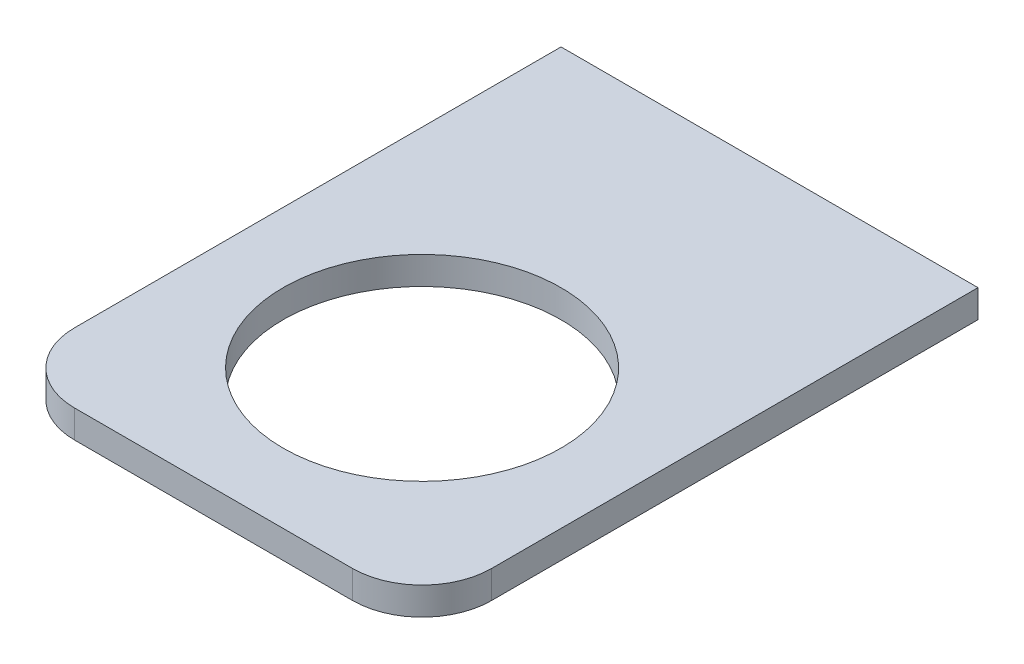
ISO-10303-21;
HEADER;
FILE_DESCRIPTION(('STEP AP214'),'2;1');
FILE_NAME('part.step','',(''),(''),'','','');
FILE_SCHEMA(('AUTOMOTIVE_DESIGN { 1 0 10303 214 1 1 1 1 }'));
ENDSEC;
DATA;
#1=APPLICATION_CONTEXT('core data for automotive mechanical design processes');
#2=APPLICATION_PROTOCOL_DEFINITION('international standard','automotive_design',2000,#1);
#3=PRODUCT_CONTEXT('',#1,'mechanical');
#4=PRODUCT('Part','Part','',(#3));
#5=PRODUCT_RELATED_PRODUCT_CATEGORY('part','',(#4));
#6=PRODUCT_DEFINITION_FORMATION('','',#4);
#7=PRODUCT_DEFINITION_CONTEXT('part definition',#1,'design');
#8=PRODUCT_DEFINITION('design','',#6,#7);
#9=PRODUCT_DEFINITION_SHAPE('','',#8);
#10=(LENGTH_UNIT() NAMED_UNIT(*) SI_UNIT(.MILLI.,.METRE.));
#11=(NAMED_UNIT(*) PLANE_ANGLE_UNIT() SI_UNIT($,.RADIAN.));
#12=(NAMED_UNIT(*) SI_UNIT($,.STERADIAN.) SOLID_ANGLE_UNIT());
#13=UNCERTAINTY_MEASURE_WITH_UNIT(LENGTH_MEASURE(1.E-05),#10,'distance_accuracy_value','');
#14=(GEOMETRIC_REPRESENTATION_CONTEXT(3) GLOBAL_UNCERTAINTY_ASSIGNED_CONTEXT((#13)) GLOBAL_UNIT_ASSIGNED_CONTEXT((#10,
#11,#12)) REPRESENTATION_CONTEXT('',''));
#15=CARTESIAN_POINT('',(0.,0.,0.));
#16=DIRECTION('',(0.,0.,1.));
#17=DIRECTION('',(1.,0.,0.));
#18=AXIS2_PLACEMENT_3D('',#15,#16,#17);
#19=CARTESIAN_POINT('',(-30.,176.,0.));
#20=DIRECTION('',(-1.,0.,0.));
#21=DIRECTION('',(0.,0.,1.));
#22=AXIS2_PLACEMENT_3D('',#19,#20,#21);
#23=PLANE('',#22);
#24=DIRECTION('',(0.,0.,1.));
#25=VECTOR('',#24,1.);
#26=CARTESIAN_POINT('',(-30.,176.,0.));
#27=LINE('',#26,#25);
#28=CARTESIAN_POINT('',(-30.,176.,0.));
#29=VERTEX_POINT('',#28);
#30=CARTESIAN_POINT('',(-30.,176.,70.));
#31=VERTEX_POINT('',#30);
#32=EDGE_CURVE('E114',#29,#31,#27,.T.);
#33=ORIENTED_EDGE('',*,*,#32,.T.);
#34=DIRECTION('',(0.,1.,0.));
#35=VECTOR('',#34,1.);
#36=CARTESIAN_POINT('',(-30.,176.,70.));
#37=LINE('',#36,#35);
#38=CARTESIAN_POINT('',(-30.,180.,70.));
#39=VERTEX_POINT('',#38);
#40=EDGE_CURVE('E135',#31,#39,#37,.T.);
#41=ORIENTED_EDGE('',*,*,#40,.T.);
#42=DIRECTION('',(0.,0.,1.));
#43=VECTOR('',#42,1.);
#44=CARTESIAN_POINT('',(-30.,180.,0.));
#45=LINE('',#44,#43);
#46=CARTESIAN_POINT('',(-30.,180.,0.));
#47=VERTEX_POINT('',#46);
#48=EDGE_CURVE('E121',#47,#39,#45,.T.);
#49=ORIENTED_EDGE('',*,*,#48,.F.);
#50=DIRECTION('',(0.,1.,0.));
#51=VECTOR('',#50,1.);
#52=CARTESIAN_POINT('',(-30.,176.,0.));
#53=LINE('',#52,#51);
#54=EDGE_CURVE('E109',#29,#47,#53,.T.);
#55=ORIENTED_EDGE('',*,*,#54,.F.);
#56=EDGE_LOOP('',(#33,#41,#49,#55));
#57=FACE_BOUND('',#56,.T.);
#58=ADVANCED_FACE('F41',(#57),#23,.T.);
#59=CARTESIAN_POINT('',(-30.,176.,0.));
#60=DIRECTION('',(0.,0.,-1.));
#61=DIRECTION('',(-1.,0.,0.));
#62=AXIS2_PLACEMENT_3D('',#59,#60,#61);
#63=PLANE('',#62);
#64=DIRECTION('',(-1.,0.,0.));
#65=VECTOR('',#64,1.);
#66=CARTESIAN_POINT('',(-30.,180.,0.));
#67=LINE('',#66,#65);
#68=CARTESIAN_POINT('',(30.,180.,0.));
#69=VERTEX_POINT('',#68);
#70=EDGE_CURVE('E107',#69,#47,#67,.T.);
#71=ORIENTED_EDGE('',*,*,#70,.F.);
#72=DIRECTION('',(0.,1.,0.));
#73=VECTOR('',#72,1.);
#74=CARTESIAN_POINT('',(30.,176.,0.));
#75=LINE('',#74,#73);
#76=CARTESIAN_POINT('',(30.,176.,0.));
#77=VERTEX_POINT('',#76);
#78=EDGE_CURVE('E96',#77,#69,#75,.T.);
#79=ORIENTED_EDGE('',*,*,#78,.F.);
#80=DIRECTION('',(-1.,0.,0.));
#81=VECTOR('',#80,1.);
#82=CARTESIAN_POINT('',(-30.,176.,0.));
#83=LINE('',#82,#81);
#84=EDGE_CURVE('E100',#77,#29,#83,.T.);
#85=ORIENTED_EDGE('',*,*,#84,.T.);
#86=ORIENTED_EDGE('',*,*,#54,.T.);
#87=EDGE_LOOP('',(#71,#79,#85,#86));
#88=FACE_BOUND('',#87,.T.);
#89=ADVANCED_FACE('F105',(#88),#63,.T.);
#90=CARTESIAN_POINT('',(30.,176.,0.));
#91=DIRECTION('',(1.,0.,0.));
#92=DIRECTION('',(0.,0.,-1.));
#93=AXIS2_PLACEMENT_3D('',#90,#91,#92);
#94=PLANE('',#93);
#95=DIRECTION('',(0.,0.,-1.));
#96=VECTOR('',#95,1.);
#97=CARTESIAN_POINT('',(30.,180.,0.));
#98=LINE('',#97,#96);
#99=CARTESIAN_POINT('',(30.,180.,70.));
#100=VERTEX_POINT('',#99);
#101=EDGE_CURVE('E129',#100,#69,#98,.T.);
#102=ORIENTED_EDGE('',*,*,#101,.F.);
#103=DIRECTION('',(0.,1.,0.));
#104=VECTOR('',#103,1.);
#105=CARTESIAN_POINT('',(30.,176.,70.));
#106=LINE('',#105,#104);
#107=CARTESIAN_POINT('',(30.,176.,70.));
#108=VERTEX_POINT('',#107);
#109=EDGE_CURVE('E11',#100,#108,#106,.F.);
#110=ORIENTED_EDGE('',*,*,#109,.T.);
#111=DIRECTION('',(0.,0.,-1.));
#112=VECTOR('',#111,1.);
#113=CARTESIAN_POINT('',(30.,176.,0.));
#114=LINE('',#113,#112);
#115=EDGE_CURVE('E93',#108,#77,#114,.T.);
#116=ORIENTED_EDGE('',*,*,#115,.T.);
#117=ORIENTED_EDGE('',*,*,#78,.T.);
#118=EDGE_LOOP('',(#102,#110,#116,#117));
#119=FACE_BOUND('',#118,.T.);
#120=ADVANCED_FACE('F95',(#119),#94,.T.);
#121=CARTESIAN_POINT('',(-30.,176.,80.));
#122=DIRECTION('',(0.,0.,1.));
#123=DIRECTION('',(1.,0.,0.));
#124=AXIS2_PLACEMENT_3D('',#121,#122,#123);
#125=PLANE('',#124);
#126=DIRECTION('',(1.,0.,0.));
#127=VECTOR('',#126,1.);
#128=CARTESIAN_POINT('',(-30.,180.,80.));
#129=LINE('',#128,#127);
#130=CARTESIAN_POINT('',(-20.,180.,80.));
#131=VERTEX_POINT('',#130);
#132=CARTESIAN_POINT('',(20.,180.,80.));
#133=VERTEX_POINT('',#132);
#134=EDGE_CURVE('E124',#131,#133,#129,.T.);
#135=ORIENTED_EDGE('',*,*,#134,.F.);
#136=DIRECTION('',(0.,1.,0.));
#137=VECTOR('',#136,1.);
#138=CARTESIAN_POINT('',(-20.,176.,80.));
#139=LINE('',#138,#137);
#140=CARTESIAN_POINT('',(-20.,176.,80.));
#141=VERTEX_POINT('',#140);
#142=EDGE_CURVE('E150',#131,#141,#139,.F.);
#143=ORIENTED_EDGE('',*,*,#142,.T.);
#144=DIRECTION('',(1.,0.,0.));
#145=VECTOR('',#144,1.);
#146=CARTESIAN_POINT('',(-30.,176.,80.));
#147=LINE('',#146,#145);
#148=CARTESIAN_POINT('',(20.,176.,80.));
#149=VERTEX_POINT('',#148);
#150=EDGE_CURVE('E101',#141,#149,#147,.T.);
#151=ORIENTED_EDGE('',*,*,#150,.T.);
#152=DIRECTION('',(0.,1.,0.));
#153=VECTOR('',#152,1.);
#154=CARTESIAN_POINT('',(20.,176.,80.));
#155=LINE('',#154,#153);
#156=EDGE_CURVE('E146',#149,#133,#155,.T.);
#157=ORIENTED_EDGE('',*,*,#156,.T.);
#158=EDGE_LOOP('',(#135,#143,#151,#157));
#159=FACE_BOUND('',#158,.T.);
#160=ADVANCED_FACE('F169',(#159),#125,.T.);
#161=CARTESIAN_POINT('',(0.,176.,0.));
#162=DIRECTION('',(0.,1.,0.));
#163=DIRECTION('',(0.,0.,1.));
#164=AXIS2_PLACEMENT_3D('',#161,#162,#163);
#165=PLANE('',#164);
#166=CARTESIAN_POINT('',(0.,176.,50.));
#167=DIRECTION('',(0.,1.,0.));
#168=DIRECTION('',(0.,0.,1.));
#169=AXIS2_PLACEMENT_3D('',#166,#167,#168);
#170=CIRCLE('',#169,20.);
#171=CARTESIAN_POINT('',(0.,176.,70.));
#172=VERTEX_POINT('',#171);
#173=EDGE_CURVE('E125',#172,#172,#170,.T.);
#174=ORIENTED_EDGE('',*,*,#173,.T.);
#175=EDGE_LOOP('',(#174));
#176=FACE_BOUND('',#175,.T.);
#177=ORIENTED_EDGE('',*,*,#150,.F.);
#178=CARTESIAN_POINT('',(-20.,176.,70.));
#179=DIRECTION('',(0.,1.,0.));
#180=DIRECTION('',(0.,0.,1.));
#181=AXIS2_PLACEMENT_3D('',#178,#179,#180);
#182=CIRCLE('',#181,10.);
#183=EDGE_CURVE('E50',#141,#31,#182,.F.);
#184=ORIENTED_EDGE('',*,*,#183,.T.);
#185=ORIENTED_EDGE('',*,*,#32,.F.);
#186=ORIENTED_EDGE('',*,*,#84,.F.);
#187=ORIENTED_EDGE('',*,*,#115,.F.);
#188=CARTESIAN_POINT('',(20.,176.,70.));
#189=DIRECTION('',(0.,1.,0.));
#190=DIRECTION('',(0.,0.,1.));
#191=AXIS2_PLACEMENT_3D('',#188,#189,#190);
#192=CIRCLE('',#191,10.);
#193=EDGE_CURVE('E62',#108,#149,#192,.F.);
#194=ORIENTED_EDGE('',*,*,#193,.T.);
#195=EDGE_LOOP('',(#177,#184,#185,#186,#187,#194));
#196=FACE_BOUND('',#195,.T.);
#197=ADVANCED_FACE('F112',(#176,#196),#165,.F.);
#198=CARTESIAN_POINT('',(0.,180.,0.));
#199=DIRECTION('',(0.,1.,0.));
#200=DIRECTION('',(0.,0.,1.));
#201=AXIS2_PLACEMENT_3D('',#198,#199,#200);
#202=PLANE('',#201);
#203=CARTESIAN_POINT('',(0.,180.,50.));
#204=DIRECTION('',(0.,1.,0.));
#205=DIRECTION('',(0.,0.,1.));
#206=AXIS2_PLACEMENT_3D('',#203,#204,#205);
#207=CIRCLE('',#206,20.);
#208=CARTESIAN_POINT('',(0.,180.,70.));
#209=VERTEX_POINT('',#208);
#210=EDGE_CURVE('E203',#209,#209,#207,.T.);
#211=ORIENTED_EDGE('',*,*,#210,.F.);
#212=EDGE_LOOP('',(#211));
#213=FACE_BOUND('',#212,.T.);
#214=ORIENTED_EDGE('',*,*,#48,.T.);
#215=CARTESIAN_POINT('',(-20.,180.,70.));
#216=DIRECTION('',(0.,1.,0.));
#217=DIRECTION('',(0.,0.,1.));
#218=AXIS2_PLACEMENT_3D('',#215,#216,#217);
#219=CIRCLE('',#218,10.);
#220=EDGE_CURVE('E143',#39,#131,#219,.T.);
#221=ORIENTED_EDGE('',*,*,#220,.T.);
#222=ORIENTED_EDGE('',*,*,#134,.T.);
#223=CARTESIAN_POINT('',(20.,180.,70.));
#224=DIRECTION('',(0.,1.,0.));
#225=DIRECTION('',(0.,0.,1.));
#226=AXIS2_PLACEMENT_3D('',#223,#224,#225);
#227=CIRCLE('',#226,10.);
#228=EDGE_CURVE('E140',#133,#100,#227,.T.);
#229=ORIENTED_EDGE('',*,*,#228,.T.);
#230=ORIENTED_EDGE('',*,*,#101,.T.);
#231=ORIENTED_EDGE('',*,*,#70,.T.);
#232=EDGE_LOOP('',(#214,#221,#222,#229,#230,#231));
#233=FACE_BOUND('',#232,.T.);
#234=ADVANCED_FACE('F167',(#213,#233),#202,.T.);
#235=CARTESIAN_POINT('',(0.,176.,50.));
#236=DIRECTION('',(0.,1.,0.));
#237=DIRECTION('',(0.,0.,1.));
#238=AXIS2_PLACEMENT_3D('',#235,#236,#237);
#239=CYLINDRICAL_SURFACE('',#238,20.);
#240=ORIENTED_EDGE('',*,*,#173,.F.);
#241=EDGE_LOOP('',(#240));
#242=FACE_BOUND('',#241,.T.);
#243=ORIENTED_EDGE('',*,*,#210,.T.);
#244=EDGE_LOOP('',(#243));
#245=FACE_BOUND('',#244,.T.);
#246=ADVANCED_FACE('F176',(#242,#245),#239,.F.);
#247=CARTESIAN_POINT('',(-20.,176.,70.));
#248=DIRECTION('',(0.,1.,0.));
#249=DIRECTION('',(0.,0.,1.));
#250=AXIS2_PLACEMENT_3D('',#247,#248,#249);
#251=CYLINDRICAL_SURFACE('',#250,10.);
#252=ORIENTED_EDGE('',*,*,#183,.F.);
#253=ORIENTED_EDGE('',*,*,#142,.F.);
#254=ORIENTED_EDGE('',*,*,#220,.F.);
#255=ORIENTED_EDGE('',*,*,#40,.F.);
#256=EDGE_LOOP('',(#252,#253,#254,#255));
#257=FACE_BOUND('',#256,.T.);
#258=ADVANCED_FACE('F164',(#257),#251,.T.);
#259=CARTESIAN_POINT('',(20.,176.,70.));
#260=DIRECTION('',(0.,1.,0.));
#261=DIRECTION('',(0.,0.,1.));
#262=AXIS2_PLACEMENT_3D('',#259,#260,#261);
#263=CYLINDRICAL_SURFACE('',#262,10.);
#264=ORIENTED_EDGE('',*,*,#193,.F.);
#265=ORIENTED_EDGE('',*,*,#109,.F.);
#266=ORIENTED_EDGE('',*,*,#228,.F.);
#267=ORIENTED_EDGE('',*,*,#156,.F.);
#268=EDGE_LOOP('',(#264,#265,#266,#267));
#269=FACE_BOUND('',#268,.T.);
#270=ADVANCED_FACE('F43',(#269),#263,.T.);
#271=CLOSED_SHELL('',(#58,#89,#120,#160,#197,#234,#246,#258,#270));
#272=MANIFOLD_SOLID_BREP('B2',#271);
#273=ADVANCED_BREP_SHAPE_REPRESENTATION('',(#18,#272),#14);
#274=SHAPE_DEFINITION_REPRESENTATION(#9,#273);
ENDSEC;
END-ISO-10303-21;
